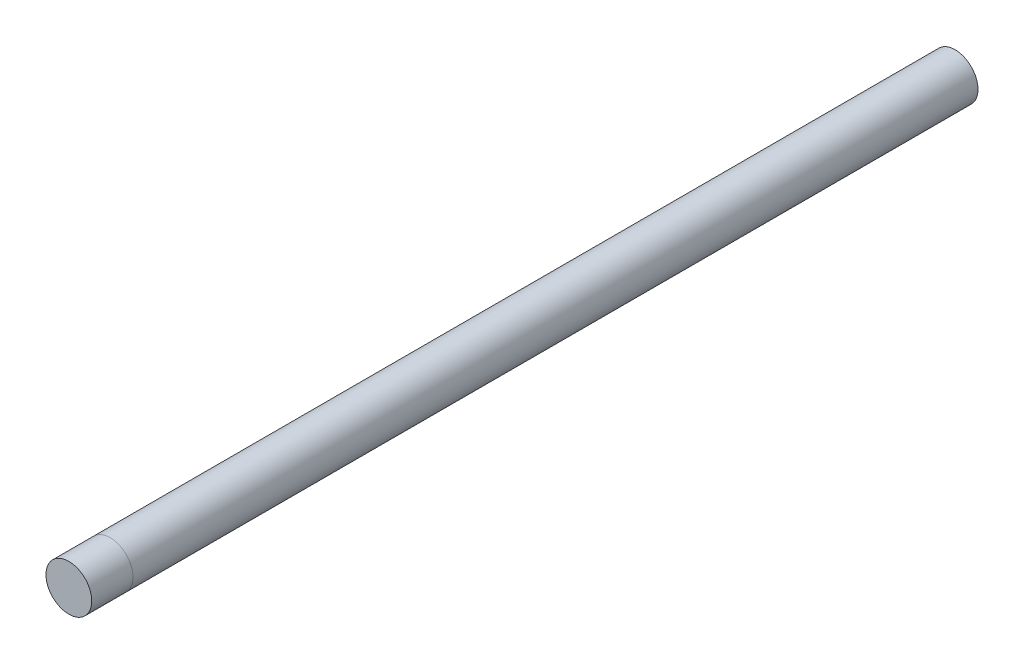
ISO-10303-21;
HEADER;
FILE_DESCRIPTION(('STEP AP214'),'2;1');
FILE_NAME('part.step','',(''),(''),'','','');
FILE_SCHEMA(('AUTOMOTIVE_DESIGN { 1 0 10303 214 1 1 1 1 }'));
ENDSEC;
DATA;
#1=APPLICATION_CONTEXT('core data for automotive mechanical design processes');
#2=APPLICATION_PROTOCOL_DEFINITION('international standard','automotive_design',2000,#1);
#3=PRODUCT_CONTEXT('',#1,'mechanical');
#4=PRODUCT('Part','Part','',(#3));
#5=PRODUCT_RELATED_PRODUCT_CATEGORY('part','',(#4));
#6=PRODUCT_DEFINITION_FORMATION('','',#4);
#7=PRODUCT_DEFINITION_CONTEXT('part definition',#1,'design');
#8=PRODUCT_DEFINITION('design','',#6,#7);
#9=PRODUCT_DEFINITION_SHAPE('','',#8);
#10=(LENGTH_UNIT() NAMED_UNIT(*) SI_UNIT(.MILLI.,.METRE.));
#11=(NAMED_UNIT(*) PLANE_ANGLE_UNIT() SI_UNIT($,.RADIAN.));
#12=(NAMED_UNIT(*) SI_UNIT($,.STERADIAN.) SOLID_ANGLE_UNIT());
#13=UNCERTAINTY_MEASURE_WITH_UNIT(LENGTH_MEASURE(1.E-05),#10,'distance_accuracy_value','');
#14=(GEOMETRIC_REPRESENTATION_CONTEXT(3) GLOBAL_UNCERTAINTY_ASSIGNED_CONTEXT((#13)) GLOBAL_UNIT_ASSIGNED_CONTEXT((#10,
#11,#12)) REPRESENTATION_CONTEXT('',''));
#15=CARTESIAN_POINT('',(0.,0.,0.));
#16=DIRECTION('',(0.,0.,1.));
#17=DIRECTION('',(1.,0.,0.));
#18=AXIS2_PLACEMENT_3D('',#15,#16,#17);
#19=CARTESIAN_POINT('',(0.,0.,193.5));
#20=DIRECTION('',(0.,0.,-1.));
#21=DIRECTION('',(-1.,0.,0.));
#22=AXIS2_PLACEMENT_3D('',#19,#20,#21);
#23=CYLINDRICAL_SURFACE('',#22,5.);
#24=CARTESIAN_POINT('',(0.,0.,193.5));
#25=DIRECTION('',(0.,0.,1.));
#26=DIRECTION('',(1.,0.,0.));
#27=AXIS2_PLACEMENT_3D('',#24,#25,#26);
#28=CIRCLE('',#27,5.);
#29=CARTESIAN_POINT('',(5.,0.,193.5));
#30=VERTEX_POINT('',#29);
#31=EDGE_CURVE('E11',#30,#30,#28,.T.);
#32=ORIENTED_EDGE('',*,*,#31,.F.);
#33=EDGE_LOOP('',(#32));
#34=FACE_BOUND('',#33,.T.);
#35=CARTESIAN_POINT('',(0.,0.,184.5));
#36=DIRECTION('',(0.,0.,1.));
#37=DIRECTION('',(1.,0.,0.));
#38=AXIS2_PLACEMENT_3D('',#35,#36,#37);
#39=CIRCLE('',#38,5.);
#40=CARTESIAN_POINT('',(5.,0.,184.5));
#41=VERTEX_POINT('',#40);
#42=EDGE_CURVE('E41',#41,#41,#39,.T.);
#43=ORIENTED_EDGE('',*,*,#42,.T.);
#44=EDGE_LOOP('',(#43));
#45=FACE_BOUND('',#44,.T.);
#46=ADVANCED_FACE('F38',(#34,#45),#23,.T.);
#47=CARTESIAN_POINT('',(0.,0.,193.5));
#48=DIRECTION('',(0.,0.,1.));
#49=DIRECTION('',(1.,0.,0.));
#50=AXIS2_PLACEMENT_3D('',#47,#48,#49);
#51=PLANE('',#50);
#52=ORIENTED_EDGE('',*,*,#31,.T.);
#53=EDGE_LOOP('',(#52));
#54=FACE_BOUND('',#53,.T.);
#55=ADVANCED_FACE('F53',(#54),#51,.T.);
#56=CARTESIAN_POINT('',(0.,0.,184.5));
#57=DIRECTION('',(0.,0.,1.));
#58=DIRECTION('',(1.,0.,0.));
#59=AXIS2_PLACEMENT_3D('',#56,#57,#58);
#60=PLANE('',#59);
#61=ORIENTED_EDGE('',*,*,#42,.F.);
#62=EDGE_LOOP('',(#61));
#63=FACE_BOUND('',#62,.T.);
#64=ADVANCED_FACE('F51',(#63),#60,.F.);
#65=CLOSED_SHELL('',(#46,#55,#64));
#66=MANIFOLD_SOLID_BREP('B2',#65);
#67=CARTESIAN_POINT('',(0.,0.,184.5));
#68=DIRECTION('',(0.,0.,-1.));
#69=DIRECTION('',(-1.,0.,0.));
#70=AXIS2_PLACEMENT_3D('',#67,#68,#69);
#71=CYLINDRICAL_SURFACE('',#70,5.);
#72=CARTESIAN_POINT('',(0.,0.,184.5));
#73=DIRECTION('',(0.,0.,1.));
#74=DIRECTION('',(1.,0.,0.));
#75=AXIS2_PLACEMENT_3D('',#72,#73,#74);
#76=CIRCLE('',#75,5.);
#77=CARTESIAN_POINT('',(5.,0.,184.5));
#78=VERTEX_POINT('',#77);
#79=EDGE_CURVE('E37',#78,#78,#76,.T.);
#80=ORIENTED_EDGE('',*,*,#79,.F.);
#81=EDGE_LOOP('',(#80));
#82=FACE_BOUND('',#81,.T.);
#83=CARTESIAN_POINT('',(0.,0.,0.));
#84=DIRECTION('',(0.,0.,1.));
#85=DIRECTION('',(1.,0.,0.));
#86=AXIS2_PLACEMENT_3D('',#83,#84,#85);
#87=CIRCLE('',#86,5.);
#88=CARTESIAN_POINT('',(5.,0.,0.));
#89=VERTEX_POINT('',#88);
#90=EDGE_CURVE('E81',#89,#89,#87,.T.);
#91=ORIENTED_EDGE('',*,*,#90,.T.);
#92=EDGE_LOOP('',(#91));
#93=FACE_BOUND('',#92,.T.);
#94=ADVANCED_FACE('F78',(#82,#93),#71,.T.);
#95=CARTESIAN_POINT('',(0.,0.,184.5));
#96=DIRECTION('',(0.,0.,1.));
#97=DIRECTION('',(1.,0.,0.));
#98=AXIS2_PLACEMENT_3D('',#95,#96,#97);
#99=PLANE('',#98);
#100=ORIENTED_EDGE('',*,*,#79,.T.);
#101=EDGE_LOOP('',(#100));
#102=FACE_BOUND('',#101,.T.);
#103=ADVANCED_FACE('F93',(#102),#99,.T.);
#104=CARTESIAN_POINT('',(0.,0.,0.));
#105=DIRECTION('',(0.,0.,1.));
#106=DIRECTION('',(1.,0.,0.));
#107=AXIS2_PLACEMENT_3D('',#104,#105,#106);
#108=PLANE('',#107);
#109=ORIENTED_EDGE('',*,*,#90,.F.);
#110=EDGE_LOOP('',(#109));
#111=FACE_BOUND('',#110,.T.);
#112=ADVANCED_FACE('F91',(#111),#108,.F.);
#113=CLOSED_SHELL('',(#94,#103,#112));
#114=MANIFOLD_SOLID_BREP('B6',#113);
#115=ADVANCED_BREP_SHAPE_REPRESENTATION('',(#18,#66,#114),#14);
#116=SHAPE_DEFINITION_REPRESENTATION(#9,#115);
ENDSEC;
END-ISO-10303-21;
